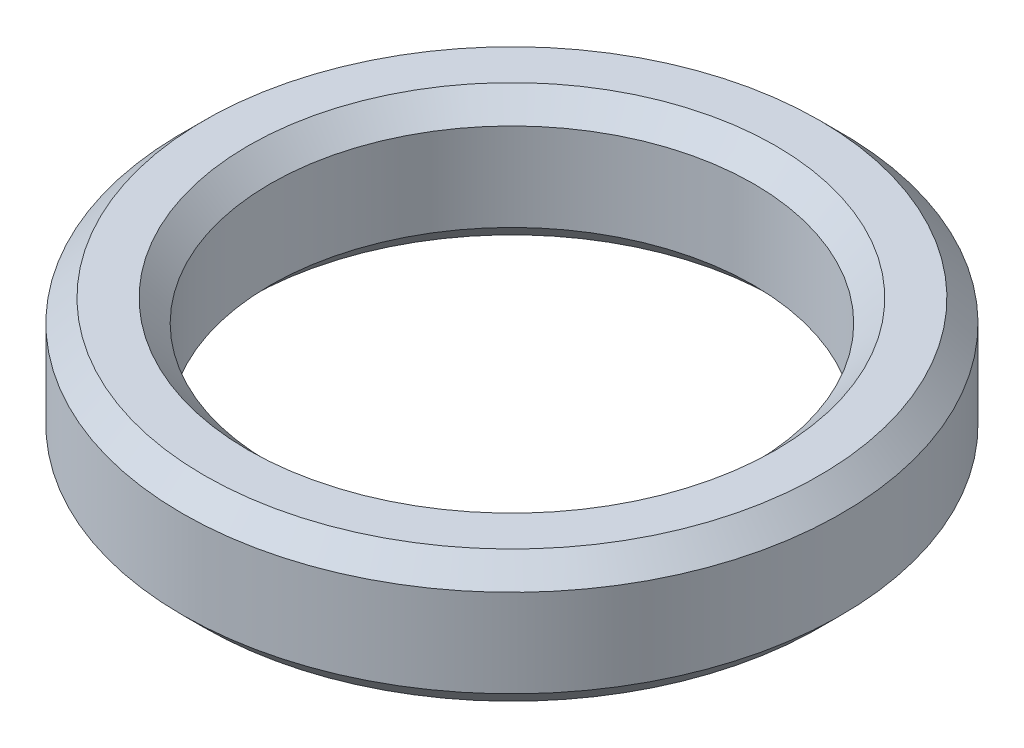
ISO-10303-21;
HEADER;
FILE_DESCRIPTION(('STEP AP214'),'2;1');
FILE_NAME('part.step','',(''),(''),'','','');
FILE_SCHEMA(('AUTOMOTIVE_DESIGN { 1 0 10303 214 1 1 1 1 }'));
ENDSEC;
DATA;
#1=APPLICATION_CONTEXT('core data for automotive mechanical design processes');
#2=APPLICATION_PROTOCOL_DEFINITION('international standard','automotive_design',2000,#1);
#3=PRODUCT_CONTEXT('',#1,'mechanical');
#4=PRODUCT('Part','Part','',(#3));
#5=PRODUCT_RELATED_PRODUCT_CATEGORY('part','',(#4));
#6=PRODUCT_DEFINITION_FORMATION('','',#4);
#7=PRODUCT_DEFINITION_CONTEXT('part definition',#1,'design');
#8=PRODUCT_DEFINITION('design','',#6,#7);
#9=PRODUCT_DEFINITION_SHAPE('','',#8);
#10=(LENGTH_UNIT() NAMED_UNIT(*) SI_UNIT(.MILLI.,.METRE.));
#11=(NAMED_UNIT(*) PLANE_ANGLE_UNIT() SI_UNIT($,.RADIAN.));
#12=(NAMED_UNIT(*) SI_UNIT($,.STERADIAN.) SOLID_ANGLE_UNIT());
#13=UNCERTAINTY_MEASURE_WITH_UNIT(LENGTH_MEASURE(1.E-05),#10,'distance_accuracy_value','');
#14=(GEOMETRIC_REPRESENTATION_CONTEXT(3) GLOBAL_UNCERTAINTY_ASSIGNED_CONTEXT((#13)) GLOBAL_UNIT_ASSIGNED_CONTEXT((#10,
#11,#12)) REPRESENTATION_CONTEXT('',''));
#15=CARTESIAN_POINT('',(0.,0.,0.));
#16=DIRECTION('',(0.,0.,1.));
#17=DIRECTION('',(1.,0.,0.));
#18=AXIS2_PLACEMENT_3D('',#15,#16,#17);
#19=CARTESIAN_POINT('',(0.,3.,0.));
#20=DIRECTION('',(0.,1.,0.));
#21=DIRECTION('',(0.,0.,1.));
#22=AXIS2_PLACEMENT_3D('',#19,#20,#21);
#23=PLANE('',#22);
#24=CARTESIAN_POINT('',(0.,3.,0.));
#25=DIRECTION('',(0.,1.,0.));
#26=DIRECTION('',(0.,0.,1.));
#27=AXIS2_PLACEMENT_3D('',#24,#25,#26);
#28=CIRCLE('',#27,6.);
#29=CARTESIAN_POINT('',(0.,3.,6.));
#30=VERTEX_POINT('',#29);
#31=EDGE_CURVE('E10',#30,#30,#28,.F.);
#32=ORIENTED_EDGE('',*,*,#31,.T.);
#33=EDGE_LOOP('',(#32));
#34=FACE_BOUND('',#33,.T.);
#35=CARTESIAN_POINT('',(0.,3.,0.));
#36=DIRECTION('',(0.,1.,0.));
#37=DIRECTION('',(0.,0.,1.));
#38=AXIS2_PLACEMENT_3D('',#35,#36,#37);
#39=CIRCLE('',#38,6.99999999999999);
#40=CARTESIAN_POINT('',(0.,3.,6.99999999999999));
#41=VERTEX_POINT('',#40);
#42=EDGE_CURVE('E39',#41,#41,#39,.T.);
#43=ORIENTED_EDGE('',*,*,#42,.T.);
#44=EDGE_LOOP('',(#43));
#45=FACE_BOUND('',#44,.T.);
#46=ADVANCED_FACE('F32',(#34,#45),#23,.T.);
#47=CARTESIAN_POINT('',(0.,0.,0.));
#48=DIRECTION('',(0.,1.,0.));
#49=DIRECTION('',(0.,0.,1.));
#50=AXIS2_PLACEMENT_3D('',#47,#48,#49);
#51=PLANE('',#50);
#52=CARTESIAN_POINT('',(0.,0.,0.));
#53=DIRECTION('',(0.,1.,0.));
#54=DIRECTION('',(0.,0.,1.));
#55=AXIS2_PLACEMENT_3D('',#52,#53,#54);
#56=CIRCLE('',#55,6.);
#57=CARTESIAN_POINT('',(0.,0.,6.));
#58=VERTEX_POINT('',#57);
#59=EDGE_CURVE('E58',#58,#58,#56,.T.);
#60=ORIENTED_EDGE('',*,*,#59,.T.);
#61=EDGE_LOOP('',(#60));
#62=FACE_BOUND('',#61,.T.);
#63=CARTESIAN_POINT('',(0.,0.,0.));
#64=DIRECTION('',(0.,1.,0.));
#65=DIRECTION('',(0.,0.,1.));
#66=AXIS2_PLACEMENT_3D('',#63,#64,#65);
#67=CIRCLE('',#66,7.);
#68=CARTESIAN_POINT('',(0.,0.,7.));
#69=VERTEX_POINT('',#68);
#70=EDGE_CURVE('E61',#69,#69,#67,.F.);
#71=ORIENTED_EDGE('',*,*,#70,.T.);
#72=EDGE_LOOP('',(#71));
#73=FACE_BOUND('',#72,.T.);
#74=ADVANCED_FACE('F65',(#62,#73),#51,.F.);
#75=CARTESIAN_POINT('',(0.,3.,0.));
#76=DIRECTION('',(0.,-1.,0.));
#77=DIRECTION('',(0.,0.,-1.));
#78=AXIS2_PLACEMENT_3D('',#75,#76,#77);
#79=CYLINDRICAL_SURFACE('',#78,7.5);
#80=CARTESIAN_POINT('',(0.,0.5,0.));
#81=DIRECTION('',(0.,1.,0.));
#82=DIRECTION('',(0.,0.,1.));
#83=AXIS2_PLACEMENT_3D('',#80,#81,#82);
#84=CIRCLE('',#83,7.5);
#85=CARTESIAN_POINT('',(0.,0.5,7.5));
#86=VERTEX_POINT('',#85);
#87=EDGE_CURVE('E43',#86,#86,#84,.T.);
#88=ORIENTED_EDGE('',*,*,#87,.T.);
#89=EDGE_LOOP('',(#88));
#90=FACE_BOUND('',#89,.T.);
#91=CARTESIAN_POINT('',(0.,2.49999999999999,0.));
#92=DIRECTION('',(0.,1.,0.));
#93=DIRECTION('',(0.,0.,1.));
#94=AXIS2_PLACEMENT_3D('',#91,#92,#93);
#95=CIRCLE('',#94,7.5);
#96=CARTESIAN_POINT('',(0.,2.49999999999999,7.5));
#97=VERTEX_POINT('',#96);
#98=EDGE_CURVE('E47',#97,#97,#95,.F.);
#99=ORIENTED_EDGE('',*,*,#98,.T.);
#100=EDGE_LOOP('',(#99));
#101=FACE_BOUND('',#100,.T.);
#102=ADVANCED_FACE('F75',(#90,#101),#79,.T.);
#103=CARTESIAN_POINT('',(0.,3.,0.));
#104=DIRECTION('',(0.,-1.,0.));
#105=DIRECTION('',(0.,0.,-1.));
#106=AXIS2_PLACEMENT_3D('',#103,#104,#105);
#107=CYLINDRICAL_SURFACE('',#106,5.5);
#108=CARTESIAN_POINT('',(0.,0.500000000000002,0.));
#109=DIRECTION('',(0.,1.,0.));
#110=DIRECTION('',(0.,0.,1.));
#111=AXIS2_PLACEMENT_3D('',#108,#109,#110);
#112=CIRCLE('',#111,5.5);
#113=CARTESIAN_POINT('',(0.,0.500000000000002,5.5));
#114=VERTEX_POINT('',#113);
#115=EDGE_CURVE('E52',#114,#114,#112,.F.);
#116=ORIENTED_EDGE('',*,*,#115,.T.);
#117=EDGE_LOOP('',(#116));
#118=FACE_BOUND('',#117,.T.);
#119=CARTESIAN_POINT('',(0.,2.5,0.));
#120=DIRECTION('',(0.,1.,0.));
#121=DIRECTION('',(0.,0.,1.));
#122=AXIS2_PLACEMENT_3D('',#119,#120,#121);
#123=CIRCLE('',#122,5.5);
#124=CARTESIAN_POINT('',(0.,2.5,5.5));
#125=VERTEX_POINT('',#124);
#126=EDGE_CURVE('E55',#125,#125,#123,.T.);
#127=ORIENTED_EDGE('',*,*,#126,.T.);
#128=EDGE_LOOP('',(#127));
#129=FACE_BOUND('',#128,.T.);
#130=ADVANCED_FACE('F78',(#118,#129),#107,.F.);
#131=CARTESIAN_POINT('',(0.,0.,0.));
#132=DIRECTION('',(0.,-1.,0.));
#133=DIRECTION('',(0.,0.,-1.));
#134=AXIS2_PLACEMENT_3D('',#131,#132,#133);
#135=CONICAL_SURFACE('',#134,6.,0.785398163397448);
#136=ORIENTED_EDGE('',*,*,#115,.F.);
#137=EDGE_LOOP('',(#136));
#138=FACE_BOUND('',#137,.T.);
#139=ORIENTED_EDGE('',*,*,#59,.F.);
#140=EDGE_LOOP('',(#139));
#141=FACE_BOUND('',#140,.T.);
#142=ADVANCED_FACE('F71',(#138,#141),#135,.F.);
#143=CARTESIAN_POINT('',(0.,0.5,0.));
#144=DIRECTION('',(0.,1.,0.));
#145=DIRECTION('',(0.,0.,1.));
#146=AXIS2_PLACEMENT_3D('',#143,#144,#145);
#147=CONICAL_SURFACE('',#146,7.5,0.78539816339745);
#148=ORIENTED_EDGE('',*,*,#70,.F.);
#149=EDGE_LOOP('',(#148));
#150=FACE_BOUND('',#149,.T.);
#151=ORIENTED_EDGE('',*,*,#87,.F.);
#152=EDGE_LOOP('',(#151));
#153=FACE_BOUND('',#152,.T.);
#154=ADVANCED_FACE('F67',(#150,#153),#147,.T.);
#155=CARTESIAN_POINT('',(0.,2.5,0.));
#156=DIRECTION('',(0.,1.,0.));
#157=DIRECTION('',(0.,0.,1.));
#158=AXIS2_PLACEMENT_3D('',#155,#156,#157);
#159=CONICAL_SURFACE('',#158,5.5,0.78539816339745);
#160=ORIENTED_EDGE('',*,*,#31,.F.);
#161=EDGE_LOOP('',(#160));
#162=FACE_BOUND('',#161,.T.);
#163=ORIENTED_EDGE('',*,*,#126,.F.);
#164=EDGE_LOOP('',(#163));
#165=FACE_BOUND('',#164,.T.);
#166=ADVANCED_FACE('F70',(#162,#165),#159,.F.);
#167=CARTESIAN_POINT('',(0.,3.,0.));
#168=DIRECTION('',(0.,-1.,0.));
#169=DIRECTION('',(0.,0.,-1.));
#170=AXIS2_PLACEMENT_3D('',#167,#168,#169);
#171=CONICAL_SURFACE('',#170,6.99999999999999,0.785398163397447);
#172=ORIENTED_EDGE('',*,*,#98,.F.);
#173=EDGE_LOOP('',(#172));
#174=FACE_BOUND('',#173,.T.);
#175=ORIENTED_EDGE('',*,*,#42,.F.);
#176=EDGE_LOOP('',(#175));
#177=FACE_BOUND('',#176,.T.);
#178=ADVANCED_FACE('F34',(#174,#177),#171,.T.);
#179=CLOSED_SHELL('',(#46,#74,#102,#130,#142,#154,#166,#178));
#180=MANIFOLD_SOLID_BREP('B2',#179);
#181=ADVANCED_BREP_SHAPE_REPRESENTATION('',(#18,#180),#14);
#182=SHAPE_DEFINITION_REPRESENTATION(#9,#181);
ENDSEC;
END-ISO-10303-21;
